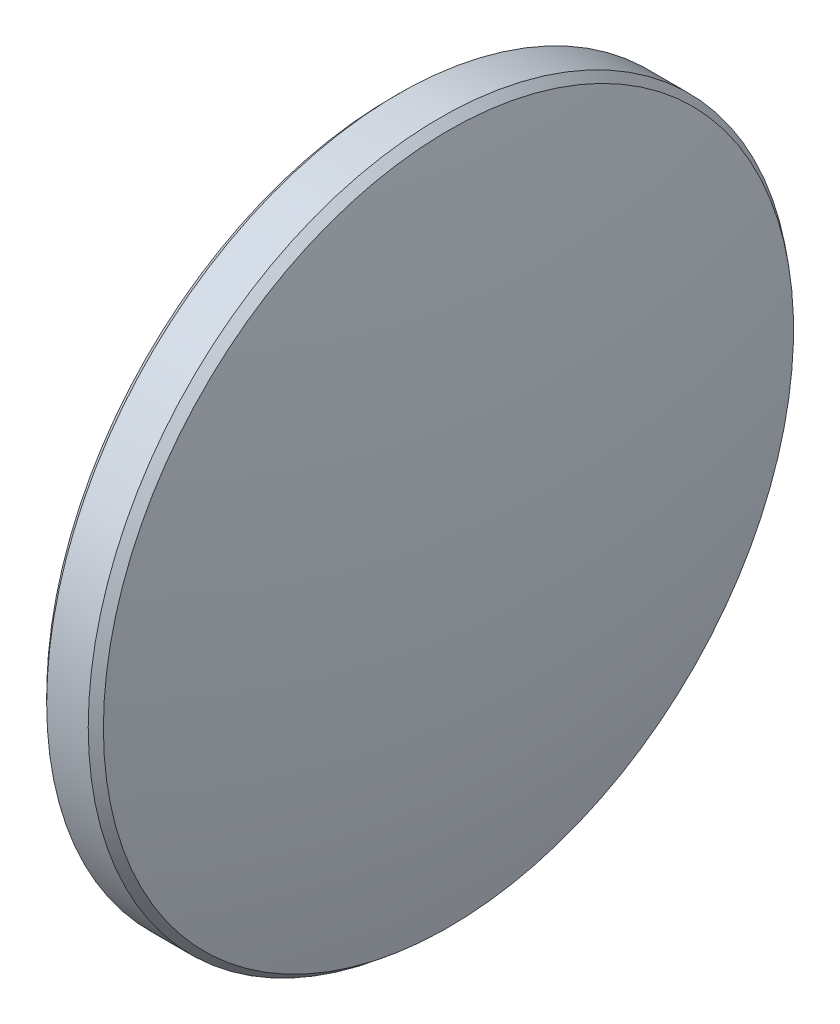
ISO-10303-21;
HEADER;
FILE_DESCRIPTION(('STEP AP214'),'2;1');
FILE_NAME('part.step','',(''),(''),'','','');
FILE_SCHEMA(('AUTOMOTIVE_DESIGN { 1 0 10303 214 1 1 1 1 }'));
ENDSEC;
DATA;
#1=APPLICATION_CONTEXT('core data for automotive mechanical design processes');
#2=APPLICATION_PROTOCOL_DEFINITION('international standard','automotive_design',2000,#1);
#3=PRODUCT_CONTEXT('',#1,'mechanical');
#4=PRODUCT('Part','Part','',(#3));
#5=PRODUCT_RELATED_PRODUCT_CATEGORY('part','',(#4));
#6=PRODUCT_DEFINITION_FORMATION('','',#4);
#7=PRODUCT_DEFINITION_CONTEXT('part definition',#1,'design');
#8=PRODUCT_DEFINITION('design','',#6,#7);
#9=PRODUCT_DEFINITION_SHAPE('','',#8);
#10=(LENGTH_UNIT() NAMED_UNIT(*) SI_UNIT(.MILLI.,.METRE.));
#11=(NAMED_UNIT(*) PLANE_ANGLE_UNIT() SI_UNIT($,.RADIAN.));
#12=(NAMED_UNIT(*) SI_UNIT($,.STERADIAN.) SOLID_ANGLE_UNIT());
#13=UNCERTAINTY_MEASURE_WITH_UNIT(LENGTH_MEASURE(1.E-05),#10,'distance_accuracy_value','');
#14=(GEOMETRIC_REPRESENTATION_CONTEXT(3) GLOBAL_UNCERTAINTY_ASSIGNED_CONTEXT((#13)) GLOBAL_UNIT_ASSIGNED_CONTEXT((#10,
#11,#12)) REPRESENTATION_CONTEXT('',''));
#15=CARTESIAN_POINT('',(0.,0.,0.));
#16=DIRECTION('',(0.,0.,1.));
#17=DIRECTION('',(1.,0.,0.));
#18=AXIS2_PLACEMENT_3D('',#15,#16,#17);
#19=CARTESIAN_POINT('',(-1.7,0.,0.));
#20=DIRECTION('',(1.,0.,0.));
#21=DIRECTION('',(0.,0.,-1.));
#22=AXIS2_PLACEMENT_3D('',#19,#20,#21);
#23=PLANE('',#22);
#24=CARTESIAN_POINT('',(-1.7,0.,0.));
#25=DIRECTION('',(1.,0.,0.));
#26=DIRECTION('',(0.,0.,-1.));
#27=AXIS2_PLACEMENT_3D('',#24,#25,#26);
#28=CIRCLE('',#27,12.45);
#29=CARTESIAN_POINT('',(-1.7,0.,-12.45));
#30=VERTEX_POINT('',#29);
#31=EDGE_CURVE('E10',#30,#30,#28,.F.);
#32=ORIENTED_EDGE('',*,*,#31,.T.);
#33=EDGE_LOOP('',(#32));
#34=FACE_BOUND('',#33,.T.);
#35=ADVANCED_FACE('F15',(#34),#23,.F.);
#36=CARTESIAN_POINT('',(-1.7,0.,0.));
#37=DIRECTION('',(-1.,0.,0.));
#38=DIRECTION('',(0.,0.,1.));
#39=AXIS2_PLACEMENT_3D('',#36,#37,#38);
#40=CYLINDRICAL_SURFACE('',#39,12.7);
#41=CARTESIAN_POINT('',(0.0500000000000084,0.,0.));
#42=DIRECTION('',(-1.,0.,0.));
#43=DIRECTION('',(0.,0.,1.));
#44=AXIS2_PLACEMENT_3D('',#41,#42,#43);
#45=CIRCLE('',#44,12.7);
#46=CARTESIAN_POINT('',(0.0500000000000084,0.,12.7));
#47=VERTEX_POINT('',#46);
#48=EDGE_CURVE('E55',#47,#47,#45,.T.);
#49=ORIENTED_EDGE('',*,*,#48,.T.);
#50=EDGE_LOOP('',(#49));
#51=FACE_BOUND('',#50,.T.);
#52=CARTESIAN_POINT('',(-1.45,0.,0.));
#53=DIRECTION('',(1.,0.,0.));
#54=DIRECTION('',(0.,0.,-1.));
#55=AXIS2_PLACEMENT_3D('',#52,#53,#54);
#56=CIRCLE('',#55,12.7);
#57=CARTESIAN_POINT('',(-1.45,0.,-12.7));
#58=VERTEX_POINT('',#57);
#59=EDGE_CURVE('E53',#58,#58,#56,.T.);
#60=ORIENTED_EDGE('',*,*,#59,.T.);
#61=EDGE_LOOP('',(#60));
#62=FACE_BOUND('',#61,.T.);
#63=ADVANCED_FACE('F28',(#51,#62),#40,.T.);
#64=CARTESIAN_POINT('',(-55.799931754537,0.,0.0885902002872594));
#65=DIRECTION('',(0.,-1.,0.));
#66=DIRECTION('',(0.,0.,1.));
#67=AXIS2_PLACEMENT_3D('',#64,#65,#66);
#68=CIRCLE('',#67,57.5);
#69=TRIMMED_CURVE('',#68,(PARAMETER_VALUE(-1.57233702653987)),
(PARAMETER_VALUE(1.57233702653987)),.T.,.PARAMETER.);
#70=CARTESIAN_POINT('',(-55.799931754537,0.,0.));
#71=DIRECTION('',(-1.,0.,0.));
#72=AXIS1_PLACEMENT('',#70,#71);
#73=SURFACE_OF_REVOLUTION('',#69,#72);
#74=CARTESIAN_POINT('',(0.354156662174442,0.,0.));
#75=DIRECTION('',(-1.,0.,0.));
#76=DIRECTION('',(0.,0.,1.));
#77=AXIS2_PLACEMENT_3D('',#74,#75,#76);
#78=CIRCLE('',#77,12.4566278008185);
#79=CARTESIAN_POINT('',(0.354156662174442,0.,12.4566278008185));
#80=VERTEX_POINT('',#79);
#81=EDGE_CURVE('E22',#80,#80,#78,.F.);
#82=ORIENTED_EDGE('',*,*,#81,.T.);
#83=EDGE_LOOP('',(#82));
#84=FACE_BOUND('',#83,.T.);
#85=CARTESIAN_POINT('',(1.7,0.,0.));
#86=VERTEX_POINT('',#85);
#87=VERTEX_LOOP('',#86);
#88=FACE_BOUND('',#87,.T.);
#89=ADVANCED_FACE('F25',(#84,#88),#73,.T.);
#90=CARTESIAN_POINT('',(0.0500000000000084,0.,0.));
#91=DIRECTION('',(-1.,0.,0.));
#92=DIRECTION('',(0.,0.,1.));
#93=AXIS2_PLACEMENT_3D('',#90,#91,#92);
#94=CONICAL_SURFACE('',#93,12.7,0.674834896370949);
#95=ORIENTED_EDGE('',*,*,#81,.F.);
#96=EDGE_LOOP('',(#95));
#97=FACE_BOUND('',#96,.T.);
#98=ORIENTED_EDGE('',*,*,#48,.F.);
#99=EDGE_LOOP('',(#98));
#100=FACE_BOUND('',#99,.T.);
#101=ADVANCED_FACE('F27',(#97,#100),#94,.T.);
#102=CARTESIAN_POINT('',(-1.7,0.,0.));
#103=DIRECTION('',(1.,0.,0.));
#104=DIRECTION('',(0.,0.,-1.));
#105=AXIS2_PLACEMENT_3D('',#102,#103,#104);
#106=CONICAL_SURFACE('',#105,12.45,0.785398163397448);
#107=ORIENTED_EDGE('',*,*,#59,.F.);
#108=EDGE_LOOP('',(#107));
#109=FACE_BOUND('',#108,.T.);
#110=ORIENTED_EDGE('',*,*,#31,.F.);
#111=EDGE_LOOP('',(#110));
#112=FACE_BOUND('',#111,.T.);
#113=ADVANCED_FACE('F17',(#109,#112),#106,.T.);
#114=CLOSED_SHELL('',(#35,#63,#89,#101,#113));
#115=MANIFOLD_SOLID_BREP('B1',#114);
#116=ADVANCED_BREP_SHAPE_REPRESENTATION('',(#18,#115),#14);
#117=SHAPE_DEFINITION_REPRESENTATION(#9,#116);
ENDSEC;
END-ISO-10303-21;
